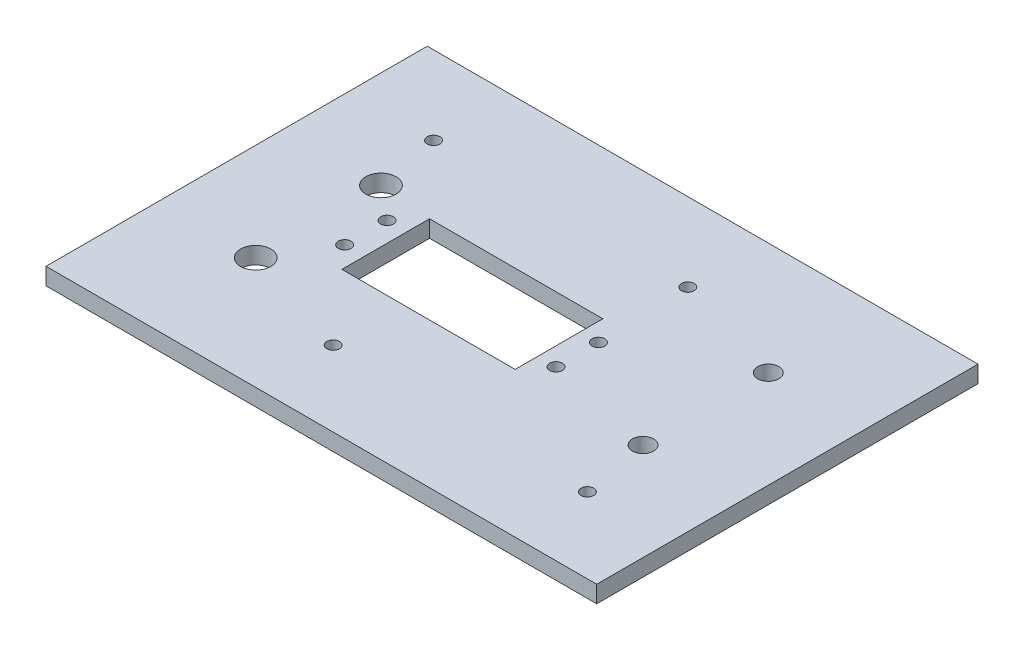
ISO-10303-21;
HEADER;
FILE_DESCRIPTION(('STEP AP214'),'2;1');
FILE_NAME('part.step','',(''),(''),'','','');
FILE_SCHEMA(('AUTOMOTIVE_DESIGN { 1 0 10303 214 1 1 1 1 }'));
ENDSEC;
DATA;
#1=APPLICATION_CONTEXT('core data for automotive mechanical design processes');
#2=APPLICATION_PROTOCOL_DEFINITION('international standard','automotive_design',2000,#1);
#3=PRODUCT_CONTEXT('',#1,'mechanical');
#4=PRODUCT('Part','Part','',(#3));
#5=PRODUCT_RELATED_PRODUCT_CATEGORY('part','',(#4));
#6=PRODUCT_DEFINITION_FORMATION('','',#4);
#7=PRODUCT_DEFINITION_CONTEXT('part definition',#1,'design');
#8=PRODUCT_DEFINITION('design','',#6,#7);
#9=PRODUCT_DEFINITION_SHAPE('','',#8);
#10=(LENGTH_UNIT() NAMED_UNIT(*) SI_UNIT(.MILLI.,.METRE.));
#11=(NAMED_UNIT(*) PLANE_ANGLE_UNIT() SI_UNIT($,.RADIAN.));
#12=(NAMED_UNIT(*) SI_UNIT($,.STERADIAN.) SOLID_ANGLE_UNIT());
#13=UNCERTAINTY_MEASURE_WITH_UNIT(LENGTH_MEASURE(1.E-05),#10,'distance_accuracy_value','');
#14=(GEOMETRIC_REPRESENTATION_CONTEXT(3) GLOBAL_UNCERTAINTY_ASSIGNED_CONTEXT((#13)) GLOBAL_UNIT_ASSIGNED_CONTEXT((#10,
#11,#12)) REPRESENTATION_CONTEXT('',''));
#15=CARTESIAN_POINT('',(0.,0.,0.));
#16=DIRECTION('',(0.,0.,1.));
#17=DIRECTION('',(1.,0.,0.));
#18=AXIS2_PLACEMENT_3D('',#15,#16,#17);
#19=CARTESIAN_POINT('',(-105.,4.,51.6723666974367));
#20=DIRECTION('',(1.,0.,0.));
#21=DIRECTION('',(0.,0.,-1.));
#22=AXIS2_PLACEMENT_3D('',#19,#20,#21);
#23=PLANE('',#22);
#24=DIRECTION('',(0.,0.,1.));
#25=VECTOR('',#24,1.);
#26=CARTESIAN_POINT('',(-105.,0.,51.6723666974367));
#27=LINE('',#26,#25);
#28=CARTESIAN_POINT('',(-105.,0.,-38.3276333025633));
#29=VERTEX_POINT('',#28);
#30=CARTESIAN_POINT('',(-105.,0.,51.6723666974367));
#31=VERTEX_POINT('',#30);
#32=EDGE_CURVE('E156',#29,#31,#27,.T.);
#33=ORIENTED_EDGE('',*,*,#32,.T.);
#34=DIRECTION('',(0.,-1.,0.));
#35=VECTOR('',#34,1.);
#36=CARTESIAN_POINT('',(-105.,4.,51.6723666974367));
#37=LINE('',#36,#35);
#38=CARTESIAN_POINT('',(-105.,4.,51.6723666974367));
#39=VERTEX_POINT('',#38);
#40=EDGE_CURVE('E11',#39,#31,#37,.T.);
#41=ORIENTED_EDGE('',*,*,#40,.F.);
#42=DIRECTION('',(0.,0.,1.));
#43=VECTOR('',#42,1.);
#44=CARTESIAN_POINT('',(-105.,4.,51.6723666974367));
#45=LINE('',#44,#43);
#46=CARTESIAN_POINT('',(-105.,4.,-38.3276333025633));
#47=VERTEX_POINT('',#46);
#48=EDGE_CURVE('E145',#47,#39,#45,.T.);
#49=ORIENTED_EDGE('',*,*,#48,.F.);
#50=DIRECTION('',(0.,-1.,0.));
#51=VECTOR('',#50,1.);
#52=CARTESIAN_POINT('',(-105.,4.,-38.3276333025633));
#53=LINE('',#52,#51);
#54=EDGE_CURVE('E155',#47,#29,#53,.T.);
#55=ORIENTED_EDGE('',*,*,#54,.T.);
#56=EDGE_LOOP('',(#33,#41,#49,#55));
#57=FACE_BOUND('',#56,.T.);
#58=ADVANCED_FACE('F32',(#57),#23,.F.);
#59=CARTESIAN_POINT('',(-105.,4.,51.6723666974367));
#60=DIRECTION('',(0.,0.,-1.));
#61=DIRECTION('',(-1.,0.,0.));
#62=AXIS2_PLACEMENT_3D('',#59,#60,#61);
#63=PLANE('',#62);
#64=DIRECTION('',(1.,0.,0.));
#65=VECTOR('',#64,1.);
#66=CARTESIAN_POINT('',(-105.,0.,51.6723666974367));
#67=LINE('',#66,#65);
#68=CARTESIAN_POINT('',(25.,0.,51.6723666974367));
#69=VERTEX_POINT('',#68);
#70=EDGE_CURVE('E159',#31,#69,#67,.T.);
#71=ORIENTED_EDGE('',*,*,#70,.T.);
#72=DIRECTION('',(0.,-1.,0.));
#73=VECTOR('',#72,1.);
#74=CARTESIAN_POINT('',(25.,4.,51.6723666974367));
#75=LINE('',#74,#73);
#76=CARTESIAN_POINT('',(25.,4.,51.6723666974367));
#77=VERTEX_POINT('',#76);
#78=EDGE_CURVE('E40',#77,#69,#75,.T.);
#79=ORIENTED_EDGE('',*,*,#78,.F.);
#80=DIRECTION('',(1.,0.,0.));
#81=VECTOR('',#80,1.);
#82=CARTESIAN_POINT('',(-105.,4.,51.6723666974367));
#83=LINE('',#82,#81);
#84=EDGE_CURVE('E148',#39,#77,#83,.T.);
#85=ORIENTED_EDGE('',*,*,#84,.F.);
#86=ORIENTED_EDGE('',*,*,#40,.T.);
#87=EDGE_LOOP('',(#71,#79,#85,#86));
#88=FACE_BOUND('',#87,.T.);
#89=ADVANCED_FACE('F264',(#88),#63,.F.);
#90=CARTESIAN_POINT('',(25.,4.,51.6723666974367));
#91=DIRECTION('',(-1.,0.,0.));
#92=DIRECTION('',(0.,0.,1.));
#93=AXIS2_PLACEMENT_3D('',#90,#91,#92);
#94=PLANE('',#93);
#95=DIRECTION('',(0.,0.,-1.));
#96=VECTOR('',#95,1.);
#97=CARTESIAN_POINT('',(25.,0.,51.6723666974367));
#98=LINE('',#97,#96);
#99=CARTESIAN_POINT('',(25.,0.,-38.3276333025633));
#100=VERTEX_POINT('',#99);
#101=EDGE_CURVE('E161',#69,#100,#98,.T.);
#102=ORIENTED_EDGE('',*,*,#101,.T.);
#103=DIRECTION('',(0.,-1.,0.));
#104=VECTOR('',#103,1.);
#105=CARTESIAN_POINT('',(25.,4.,-38.3276333025633));
#106=LINE('',#105,#104);
#107=CARTESIAN_POINT('',(25.,4.,-38.3276333025633));
#108=VERTEX_POINT('',#107);
#109=EDGE_CURVE('E166',#108,#100,#106,.T.);
#110=ORIENTED_EDGE('',*,*,#109,.F.);
#111=DIRECTION('',(0.,0.,-1.));
#112=VECTOR('',#111,1.);
#113=CARTESIAN_POINT('',(25.,4.,51.6723666974367));
#114=LINE('',#113,#112);
#115=EDGE_CURVE('E151',#77,#108,#114,.T.);
#116=ORIENTED_EDGE('',*,*,#115,.F.);
#117=ORIENTED_EDGE('',*,*,#78,.T.);
#118=EDGE_LOOP('',(#102,#110,#116,#117));
#119=FACE_BOUND('',#118,.T.);
#120=ADVANCED_FACE('F269',(#119),#94,.F.);
#121=CARTESIAN_POINT('',(-105.,4.,-38.3276333025633));
#122=DIRECTION('',(0.,0.,1.));
#123=DIRECTION('',(1.,0.,0.));
#124=AXIS2_PLACEMENT_3D('',#121,#122,#123);
#125=PLANE('',#124);
#126=DIRECTION('',(-1.,0.,0.));
#127=VECTOR('',#126,1.);
#128=CARTESIAN_POINT('',(-105.,0.,-38.3276333025633));
#129=LINE('',#128,#127);
#130=EDGE_CURVE('E149',#100,#29,#129,.T.);
#131=ORIENTED_EDGE('',*,*,#130,.T.);
#132=ORIENTED_EDGE('',*,*,#54,.F.);
#133=DIRECTION('',(-1.,0.,0.));
#134=VECTOR('',#133,1.);
#135=CARTESIAN_POINT('',(-105.,4.,-38.3276333025633));
#136=LINE('',#135,#134);
#137=EDGE_CURVE('E153',#108,#47,#136,.T.);
#138=ORIENTED_EDGE('',*,*,#137,.F.);
#139=ORIENTED_EDGE('',*,*,#109,.T.);
#140=EDGE_LOOP('',(#131,#132,#138,#139));
#141=FACE_BOUND('',#140,.T.);
#142=ADVANCED_FACE('F276',(#141),#125,.F.);
#143=CARTESIAN_POINT('',(0.,4.,0.));
#144=DIRECTION('',(0.,-1.,0.));
#145=DIRECTION('',(0.,0.,-1.));
#146=AXIS2_PLACEMENT_3D('',#143,#144,#145);
#147=PLANE('',#146);
#148=CARTESIAN_POINT('',(-25.,4.,-19.8195341520518));
#149=DIRECTION('',(0.,1.,0.));
#150=DIRECTION('',(0.,0.,1.));
#151=AXIS2_PLACEMENT_3D('',#148,#149,#150);
#152=CIRCLE('',#151,1.5);
#153=CARTESIAN_POINT('',(-25.,4.,-18.3195341520518));
#154=VERTEX_POINT('',#153);
#155=EDGE_CURVE('E196',#154,#154,#152,.T.);
#156=ORIENTED_EDGE('',*,*,#155,.F.);
#157=EDGE_LOOP('',(#156));
#158=FACE_BOUND('',#157,.T.);
#159=CARTESIAN_POINT('',(5.00000000000001,4.,33.8804658479482));
#160=DIRECTION('',(0.,1.,0.));
#161=DIRECTION('',(0.,0.,1.));
#162=AXIS2_PLACEMENT_3D('',#159,#160,#161);
#163=CIRCLE('',#162,1.5);
#164=CARTESIAN_POINT('',(5.00000000000001,4.,35.3804658479482));
#165=VERTEX_POINT('',#164);
#166=EDGE_CURVE('E207',#165,#165,#163,.T.);
#167=ORIENTED_EDGE('',*,*,#166,.F.);
#168=EDGE_LOOP('',(#167));
#169=FACE_BOUND('',#168,.T.);
#170=CARTESIAN_POINT('',(-55.,4.,33.8804658479482));
#171=DIRECTION('',(0.,1.,0.));
#172=DIRECTION('',(0.,0.,1.));
#173=AXIS2_PLACEMENT_3D('',#170,#171,#172);
#174=CIRCLE('',#173,1.5);
#175=CARTESIAN_POINT('',(-55.,4.,35.3804658479482));
#176=VERTEX_POINT('',#175);
#177=EDGE_CURVE('E213',#176,#176,#174,.T.);
#178=ORIENTED_EDGE('',*,*,#177,.F.);
#179=EDGE_LOOP('',(#178));
#180=FACE_BOUND('',#179,.T.);
#181=CARTESIAN_POINT('',(-85.,4.,-19.8195341520518));
#182=DIRECTION('',(0.,1.,0.));
#183=DIRECTION('',(0.,0.,1.));
#184=AXIS2_PLACEMENT_3D('',#181,#182,#183);
#185=CIRCLE('',#184,1.5);
#186=CARTESIAN_POINT('',(-85.,4.,-18.3195341520518));
#187=VERTEX_POINT('',#186);
#188=EDGE_CURVE('E216',#187,#187,#185,.T.);
#189=ORIENTED_EDGE('',*,*,#188,.F.);
#190=EDGE_LOOP('',(#189));
#191=FACE_BOUND('',#190,.T.);
#192=CARTESIAN_POINT('',(-24.2394353720915,4.,2.03046584794823));
#193=DIRECTION('',(0.,-1.,0.));
#194=DIRECTION('',(0.,0.,-1.));
#195=AXIS2_PLACEMENT_3D('',#192,#193,#194);
#196=CIRCLE('',#195,1.5);
#197=CARTESIAN_POINT('',(-24.2394353720915,4.,0.530465847948223));
#198=VERTEX_POINT('',#197);
#199=EDGE_CURVE('E225',#198,#198,#196,.T.);
#200=ORIENTED_EDGE('',*,*,#199,.T.);
#201=EDGE_LOOP('',(#200));
#202=FACE_BOUND('',#201,.T.);
#203=CARTESIAN_POINT('',(-74.1394353720915,4.,2.03046584794823));
#204=DIRECTION('',(0.,-1.,0.));
#205=DIRECTION('',(0.,0.,-1.));
#206=AXIS2_PLACEMENT_3D('',#203,#204,#205);
#207=CIRCLE('',#206,1.5);
#208=CARTESIAN_POINT('',(-74.1394353720915,4.,0.53046584794823));
#209=VERTEX_POINT('',#208);
#210=EDGE_CURVE('E231',#209,#209,#207,.T.);
#211=ORIENTED_EDGE('',*,*,#210,.T.);
#212=EDGE_LOOP('',(#211));
#213=FACE_BOUND('',#212,.T.);
#214=CARTESIAN_POINT('',(-24.2394353720915,4.,12.0304658479482));
#215=DIRECTION('',(0.,-1.,0.));
#216=DIRECTION('',(0.,0.,-1.));
#217=AXIS2_PLACEMENT_3D('',#214,#215,#216);
#218=CIRCLE('',#217,1.5);
#219=CARTESIAN_POINT('',(-24.2394353720915,4.,10.5304658479482));
#220=VERTEX_POINT('',#219);
#221=EDGE_CURVE('E237',#220,#220,#218,.T.);
#222=ORIENTED_EDGE('',*,*,#221,.T.);
#223=EDGE_LOOP('',(#222));
#224=FACE_BOUND('',#223,.T.);
#225=CARTESIAN_POINT('',(-74.1394353720915,4.,12.0304658479482));
#226=DIRECTION('',(0.,-1.,0.));
#227=DIRECTION('',(0.,0.,-1.));
#228=AXIS2_PLACEMENT_3D('',#225,#226,#227);
#229=CIRCLE('',#228,1.5);
#230=CARTESIAN_POINT('',(-74.1394353720915,4.,10.5304658479482));
#231=VERTEX_POINT('',#230);
#232=EDGE_CURVE('E129',#231,#231,#229,.T.);
#233=ORIENTED_EDGE('',*,*,#232,.T.);
#234=EDGE_LOOP('',(#233));
#235=FACE_BOUND('',#234,.T.);
#236=DIRECTION('',(1.,0.,0.));
#237=VECTOR('',#236,1.);
#238=CARTESIAN_POINT('',(-69.45,4.,17.3804658479482));
#239=LINE('',#238,#237);
#240=CARTESIAN_POINT('',(-69.45,4.,17.3804658479482));
#241=VERTEX_POINT('',#240);
#242=CARTESIAN_POINT('',(-28.55,4.,17.3804658479482));
#243=VERTEX_POINT('',#242);
#244=EDGE_CURVE('E128',#241,#243,#239,.T.);
#245=ORIENTED_EDGE('',*,*,#244,.F.);
#246=DIRECTION('',(0.,0.,1.));
#247=VECTOR('',#246,1.);
#248=CARTESIAN_POINT('',(-69.45,4.,-3.31953415205177));
#249=LINE('',#248,#247);
#250=CARTESIAN_POINT('',(-69.45,4.,-3.31953415205177));
#251=VERTEX_POINT('',#250);
#252=EDGE_CURVE('E48',#251,#241,#249,.T.);
#253=ORIENTED_EDGE('',*,*,#252,.F.);
#254=DIRECTION('',(-1.,0.,0.));
#255=VECTOR('',#254,1.);
#256=CARTESIAN_POINT('',(-69.45,4.,-3.31953415205177));
#257=LINE('',#256,#255);
#258=CARTESIAN_POINT('',(-28.55,4.,-3.31953415205177));
#259=VERTEX_POINT('',#258);
#260=EDGE_CURVE('E116',#259,#251,#257,.T.);
#261=ORIENTED_EDGE('',*,*,#260,.F.);
#262=DIRECTION('',(0.,0.,-1.));
#263=VECTOR('',#262,1.);
#264=CARTESIAN_POINT('',(-28.55,4.,-3.31953415205177));
#265=LINE('',#264,#263);
#266=EDGE_CURVE('E119',#243,#259,#265,.T.);
#267=ORIENTED_EDGE('',*,*,#266,.F.);
#268=EDGE_LOOP('',(#245,#253,#261,#267));
#269=FACE_BOUND('',#268,.T.);
#270=CARTESIAN_POINT('',(-82.,4.,25.1723666974366));
#271=DIRECTION('',(0.,1.,0.));
#272=DIRECTION('',(0.,0.,1.));
#273=AXIS2_PLACEMENT_3D('',#270,#271,#272);
#274=CIRCLE('',#273,3.57);
#275=CARTESIAN_POINT('',(-82.,4.,28.7423666974366));
#276=VERTEX_POINT('',#275);
#277=EDGE_CURVE('E135',#276,#276,#274,.T.);
#278=ORIENTED_EDGE('',*,*,#277,.F.);
#279=EDGE_LOOP('',(#278));
#280=FACE_BOUND('',#279,.T.);
#281=CARTESIAN_POINT('',(-82.,4.,-4.39331594725367));
#282=DIRECTION('',(0.,1.,0.));
#283=DIRECTION('',(0.,0.,1.));
#284=AXIS2_PLACEMENT_3D('',#281,#282,#283);
#285=CIRCLE('',#284,3.57);
#286=CARTESIAN_POINT('',(-82.,4.,-0.823315947253672));
#287=VERTEX_POINT('',#286);
#288=EDGE_CURVE('E141',#287,#287,#285,.T.);
#289=ORIENTED_EDGE('',*,*,#288,.F.);
#290=EDGE_LOOP('',(#289));
#291=FACE_BOUND('',#290,.T.);
#292=ORIENTED_EDGE('',*,*,#48,.T.);
#293=ORIENTED_EDGE('',*,*,#84,.T.);
#294=ORIENTED_EDGE('',*,*,#115,.T.);
#295=ORIENTED_EDGE('',*,*,#137,.T.);
#296=EDGE_LOOP('',(#292,#293,#294,#295));
#297=FACE_BOUND('',#296,.T.);
#298=CARTESIAN_POINT('',(2.00000000000002,4.,17.738049342127));
#299=DIRECTION('',(0.,1.,0.));
#300=DIRECTION('',(0.,0.,1.));
#301=AXIS2_PLACEMENT_3D('',#298,#299,#300);
#302=CIRCLE('',#301,2.5);
#303=CARTESIAN_POINT('',(2.00000000000002,4.,20.238049342127));
#304=VERTEX_POINT('',#303);
#305=EDGE_CURVE('E201',#304,#304,#302,.T.);
#306=ORIENTED_EDGE('',*,*,#305,.F.);
#307=EDGE_LOOP('',(#306));
#308=FACE_BOUND('',#307,.T.);
#309=CARTESIAN_POINT('',(2.00000000000001,4.,-11.8276333025634));
#310=DIRECTION('',(0.,1.,0.));
#311=DIRECTION('',(0.,0.,1.));
#312=AXIS2_PLACEMENT_3D('',#309,#310,#311);
#313=CIRCLE('',#312,2.5);
#314=CARTESIAN_POINT('',(2.00000000000001,4.,-9.32763330256336));
#315=VERTEX_POINT('',#314);
#316=EDGE_CURVE('E193',#315,#315,#313,.T.);
#317=ORIENTED_EDGE('',*,*,#316,.F.);
#318=EDGE_LOOP('',(#317));
#319=FACE_BOUND('',#318,.T.);
#320=ADVANCED_FACE('F178',(#158,#169,#180,#191,#202,#213,#224,#235,#269,#280,#291,#297,#308,
#319),#147,.F.);
#321=CARTESIAN_POINT('',(0.,0.,0.));
#322=DIRECTION('',(0.,-1.,0.));
#323=DIRECTION('',(0.,0.,-1.));
#324=AXIS2_PLACEMENT_3D('',#321,#322,#323);
#325=PLANE('',#324);
#326=CARTESIAN_POINT('',(-25.,0.,-19.8195341520518));
#327=DIRECTION('',(0.,1.,0.));
#328=DIRECTION('',(0.,0.,1.));
#329=AXIS2_PLACEMENT_3D('',#326,#327,#328);
#330=CIRCLE('',#329,1.5);
#331=CARTESIAN_POINT('',(-25.,0.,-18.3195341520518));
#332=VERTEX_POINT('',#331);
#333=EDGE_CURVE('E192',#332,#332,#330,.T.);
#334=ORIENTED_EDGE('',*,*,#333,.T.);
#335=EDGE_LOOP('',(#334));
#336=FACE_BOUND('',#335,.T.);
#337=CARTESIAN_POINT('',(5.00000000000001,0.,33.8804658479482));
#338=DIRECTION('',(0.,1.,0.));
#339=DIRECTION('',(0.,0.,1.));
#340=AXIS2_PLACEMENT_3D('',#337,#338,#339);
#341=CIRCLE('',#340,1.5);
#342=CARTESIAN_POINT('',(5.00000000000001,0.,35.3804658479482));
#343=VERTEX_POINT('',#342);
#344=EDGE_CURVE('E205',#343,#343,#341,.T.);
#345=ORIENTED_EDGE('',*,*,#344,.T.);
#346=EDGE_LOOP('',(#345));
#347=FACE_BOUND('',#346,.T.);
#348=CARTESIAN_POINT('',(-55.,0.,33.8804658479482));
#349=DIRECTION('',(0.,1.,0.));
#350=DIRECTION('',(0.,0.,1.));
#351=AXIS2_PLACEMENT_3D('',#348,#349,#350);
#352=CIRCLE('',#351,1.5);
#353=CARTESIAN_POINT('',(-55.,0.,35.3804658479482));
#354=VERTEX_POINT('',#353);
#355=EDGE_CURVE('E210',#354,#354,#352,.T.);
#356=ORIENTED_EDGE('',*,*,#355,.T.);
#357=EDGE_LOOP('',(#356));
#358=FACE_BOUND('',#357,.T.);
#359=CARTESIAN_POINT('',(-85.,0.,-19.8195341520518));
#360=DIRECTION('',(0.,1.,0.));
#361=DIRECTION('',(0.,0.,1.));
#362=AXIS2_PLACEMENT_3D('',#359,#360,#361);
#363=CIRCLE('',#362,1.5);
#364=CARTESIAN_POINT('',(-85.,0.,-18.3195341520518));
#365=VERTEX_POINT('',#364);
#366=EDGE_CURVE('E219',#365,#365,#363,.T.);
#367=ORIENTED_EDGE('',*,*,#366,.T.);
#368=EDGE_LOOP('',(#367));
#369=FACE_BOUND('',#368,.T.);
#370=CARTESIAN_POINT('',(-24.2394353720915,0.,2.03046584794823));
#371=DIRECTION('',(0.,-1.,0.));
#372=DIRECTION('',(0.,0.,-1.));
#373=AXIS2_PLACEMENT_3D('',#370,#371,#372);
#374=CIRCLE('',#373,1.5);
#375=CARTESIAN_POINT('',(-24.2394353720915,0.,0.530465847948223));
#376=VERTEX_POINT('',#375);
#377=EDGE_CURVE('E222',#376,#376,#374,.T.);
#378=ORIENTED_EDGE('',*,*,#377,.F.);
#379=EDGE_LOOP('',(#378));
#380=FACE_BOUND('',#379,.T.);
#381=CARTESIAN_POINT('',(-74.1394353720915,0.,2.03046584794823));
#382=DIRECTION('',(0.,-1.,0.));
#383=DIRECTION('',(0.,0.,-1.));
#384=AXIS2_PLACEMENT_3D('',#381,#382,#383);
#385=CIRCLE('',#384,1.5);
#386=CARTESIAN_POINT('',(-74.1394353720915,0.,0.53046584794823));
#387=VERTEX_POINT('',#386);
#388=EDGE_CURVE('E228',#387,#387,#385,.T.);
#389=ORIENTED_EDGE('',*,*,#388,.F.);
#390=EDGE_LOOP('',(#389));
#391=FACE_BOUND('',#390,.T.);
#392=CARTESIAN_POINT('',(-24.2394353720915,0.,12.0304658479482));
#393=DIRECTION('',(0.,-1.,0.));
#394=DIRECTION('',(0.,0.,-1.));
#395=AXIS2_PLACEMENT_3D('',#392,#393,#394);
#396=CIRCLE('',#395,1.5);
#397=CARTESIAN_POINT('',(-24.2394353720915,0.,10.5304658479482));
#398=VERTEX_POINT('',#397);
#399=EDGE_CURVE('E234',#398,#398,#396,.T.);
#400=ORIENTED_EDGE('',*,*,#399,.F.);
#401=EDGE_LOOP('',(#400));
#402=FACE_BOUND('',#401,.T.);
#403=CARTESIAN_POINT('',(-74.1394353720915,0.,12.0304658479482));
#404=DIRECTION('',(0.,-1.,0.));
#405=DIRECTION('',(0.,0.,-1.));
#406=AXIS2_PLACEMENT_3D('',#403,#404,#405);
#407=CIRCLE('',#406,1.5);
#408=CARTESIAN_POINT('',(-74.1394353720915,0.,10.5304658479482));
#409=VERTEX_POINT('',#408);
#410=EDGE_CURVE('E122',#409,#409,#407,.T.);
#411=ORIENTED_EDGE('',*,*,#410,.F.);
#412=EDGE_LOOP('',(#411));
#413=FACE_BOUND('',#412,.T.);
#414=DIRECTION('',(0.,0.,1.));
#415=VECTOR('',#414,1.);
#416=CARTESIAN_POINT('',(-69.45,0.,-3.31953415205177));
#417=LINE('',#416,#415);
#418=CARTESIAN_POINT('',(-69.45,0.,-3.31953415205177));
#419=VERTEX_POINT('',#418);
#420=CARTESIAN_POINT('',(-69.45,0.,17.3804658479482));
#421=VERTEX_POINT('',#420);
#422=EDGE_CURVE('E100',#419,#421,#417,.T.);
#423=ORIENTED_EDGE('',*,*,#422,.T.);
#424=DIRECTION('',(1.,0.,0.));
#425=VECTOR('',#424,1.);
#426=CARTESIAN_POINT('',(-69.45,0.,17.3804658479482));
#427=LINE('',#426,#425);
#428=CARTESIAN_POINT('',(-28.55,0.,17.3804658479482));
#429=VERTEX_POINT('',#428);
#430=EDGE_CURVE('E109',#421,#429,#427,.T.);
#431=ORIENTED_EDGE('',*,*,#430,.T.);
#432=DIRECTION('',(0.,0.,-1.));
#433=VECTOR('',#432,1.);
#434=CARTESIAN_POINT('',(-28.55,0.,-3.31953415205177));
#435=LINE('',#434,#433);
#436=CARTESIAN_POINT('',(-28.55,0.,-3.31953415205177));
#437=VERTEX_POINT('',#436);
#438=EDGE_CURVE('E56',#429,#437,#435,.T.);
#439=ORIENTED_EDGE('',*,*,#438,.T.);
#440=DIRECTION('',(-1.,0.,0.));
#441=VECTOR('',#440,1.);
#442=CARTESIAN_POINT('',(-69.45,0.,-3.31953415205177));
#443=LINE('',#442,#441);
#444=EDGE_CURVE('E106',#437,#419,#443,.T.);
#445=ORIENTED_EDGE('',*,*,#444,.T.);
#446=EDGE_LOOP('',(#423,#431,#439,#445));
#447=FACE_BOUND('',#446,.T.);
#448=CARTESIAN_POINT('',(-82.,0.,25.1723666974366));
#449=DIRECTION('',(0.,-1.,0.));
#450=DIRECTION('',(0.,0.,-1.));
#451=AXIS2_PLACEMENT_3D('',#448,#449,#450);
#452=CIRCLE('',#451,3.57);
#453=CARTESIAN_POINT('',(-82.,0.,21.6023666974367));
#454=VERTEX_POINT('',#453);
#455=EDGE_CURVE('E35',#454,#454,#452,.T.);
#456=ORIENTED_EDGE('',*,*,#455,.F.);
#457=EDGE_LOOP('',(#456));
#458=FACE_BOUND('',#457,.T.);
#459=CARTESIAN_POINT('',(-82.,0.,-4.39331594725367));
#460=DIRECTION('',(0.,-1.,0.));
#461=DIRECTION('',(0.,0.,-1.));
#462=AXIS2_PLACEMENT_3D('',#459,#460,#461);
#463=CIRCLE('',#462,3.57);
#464=CARTESIAN_POINT('',(-82.,0.,-7.96331594725367));
#465=VERTEX_POINT('',#464);
#466=EDGE_CURVE('E144',#465,#465,#463,.T.);
#467=ORIENTED_EDGE('',*,*,#466,.F.);
#468=EDGE_LOOP('',(#467));
#469=FACE_BOUND('',#468,.T.);
#470=ORIENTED_EDGE('',*,*,#32,.F.);
#471=ORIENTED_EDGE('',*,*,#130,.F.);
#472=ORIENTED_EDGE('',*,*,#101,.F.);
#473=ORIENTED_EDGE('',*,*,#70,.F.);
#474=EDGE_LOOP('',(#470,#471,#472,#473));
#475=FACE_BOUND('',#474,.T.);
#476=CARTESIAN_POINT('',(2.00000000000002,0.,17.738049342127));
#477=DIRECTION('',(0.,1.,0.));
#478=DIRECTION('',(0.,0.,1.));
#479=AXIS2_PLACEMENT_3D('',#476,#477,#478);
#480=CIRCLE('',#479,2.5);
#481=CARTESIAN_POINT('',(2.00000000000002,0.,20.238049342127));
#482=VERTEX_POINT('',#481);
#483=EDGE_CURVE('E187',#482,#482,#480,.T.);
#484=ORIENTED_EDGE('',*,*,#483,.T.);
#485=EDGE_LOOP('',(#484));
#486=FACE_BOUND('',#485,.T.);
#487=CARTESIAN_POINT('',(2.00000000000001,0.,-11.8276333025634));
#488=DIRECTION('',(0.,1.,0.));
#489=DIRECTION('',(0.,0.,1.));
#490=AXIS2_PLACEMENT_3D('',#487,#488,#489);
#491=CIRCLE('',#490,2.5);
#492=CARTESIAN_POINT('',(2.00000000000001,0.,-9.32763330256336));
#493=VERTEX_POINT('',#492);
#494=EDGE_CURVE('E190',#493,#493,#491,.T.);
#495=ORIENTED_EDGE('',*,*,#494,.T.);
#496=EDGE_LOOP('',(#495));
#497=FACE_BOUND('',#496,.T.);
#498=ADVANCED_FACE('F113',(#336,#347,#358,#369,#380,#391,#402,#413,#447,#458,#469,#475,#486,
#497),#325,.T.);
#499=CARTESIAN_POINT('',(-82.,-6.,-4.39331594725367));
#500=DIRECTION('',(0.,1.,0.));
#501=DIRECTION('',(0.,0.,1.));
#502=AXIS2_PLACEMENT_3D('',#499,#500,#501);
#503=CYLINDRICAL_SURFACE('',#502,3.57);
#504=ORIENTED_EDGE('',*,*,#466,.T.);
#505=EDGE_LOOP('',(#504));
#506=FACE_BOUND('',#505,.T.);
#507=ORIENTED_EDGE('',*,*,#288,.T.);
#508=EDGE_LOOP('',(#507));
#509=FACE_BOUND('',#508,.T.);
#510=ADVANCED_FACE('F173',(#506,#509),#503,.F.);
#511=CARTESIAN_POINT('',(-82.,-6.,25.1723666974366));
#512=DIRECTION('',(0.,1.,0.));
#513=DIRECTION('',(0.,0.,1.));
#514=AXIS2_PLACEMENT_3D('',#511,#512,#513);
#515=CYLINDRICAL_SURFACE('',#514,3.57);
#516=ORIENTED_EDGE('',*,*,#455,.T.);
#517=EDGE_LOOP('',(#516));
#518=FACE_BOUND('',#517,.T.);
#519=ORIENTED_EDGE('',*,*,#277,.T.);
#520=EDGE_LOOP('',(#519));
#521=FACE_BOUND('',#520,.T.);
#522=ADVANCED_FACE('F343',(#518,#521),#515,.F.);
#523=CARTESIAN_POINT('',(-69.45,0.,-3.31953415205177));
#524=DIRECTION('',(-1.,0.,0.));
#525=DIRECTION('',(0.,0.,1.));
#526=AXIS2_PLACEMENT_3D('',#523,#524,#525);
#527=PLANE('',#526);
#528=ORIENTED_EDGE('',*,*,#252,.T.);
#529=DIRECTION('',(0.,1.,0.));
#530=VECTOR('',#529,1.);
#531=CARTESIAN_POINT('',(-69.45,0.,17.3804658479482));
#532=LINE('',#531,#530);
#533=EDGE_CURVE('E96',#421,#241,#532,.T.);
#534=ORIENTED_EDGE('',*,*,#533,.F.);
#535=ORIENTED_EDGE('',*,*,#422,.F.);
#536=DIRECTION('',(0.,1.,0.));
#537=VECTOR('',#536,1.);
#538=CARTESIAN_POINT('',(-69.45,0.,-3.31953415205177));
#539=LINE('',#538,#537);
#540=EDGE_CURVE('E133',#419,#251,#539,.T.);
#541=ORIENTED_EDGE('',*,*,#540,.T.);
#542=EDGE_LOOP('',(#528,#534,#535,#541));
#543=FACE_BOUND('',#542,.T.);
#544=ADVANCED_FACE('F98',(#543),#527,.F.);
#545=CARTESIAN_POINT('',(-69.45,0.,-3.31953415205177));
#546=DIRECTION('',(0.,0.,-1.));
#547=DIRECTION('',(-1.,0.,0.));
#548=AXIS2_PLACEMENT_3D('',#545,#546,#547);
#549=PLANE('',#548);
#550=ORIENTED_EDGE('',*,*,#260,.T.);
#551=ORIENTED_EDGE('',*,*,#540,.F.);
#552=ORIENTED_EDGE('',*,*,#444,.F.);
#553=DIRECTION('',(0.,1.,0.));
#554=VECTOR('',#553,1.);
#555=CARTESIAN_POINT('',(-28.55,0.,-3.31953415205177));
#556=LINE('',#555,#554);
#557=EDGE_CURVE('E136',#437,#259,#556,.T.);
#558=ORIENTED_EDGE('',*,*,#557,.T.);
#559=EDGE_LOOP('',(#550,#551,#552,#558));
#560=FACE_BOUND('',#559,.T.);
#561=ADVANCED_FACE('F433',(#560),#549,.F.);
#562=CARTESIAN_POINT('',(-28.55,0.,-3.31953415205177));
#563=DIRECTION('',(1.,0.,0.));
#564=DIRECTION('',(0.,0.,-1.));
#565=AXIS2_PLACEMENT_3D('',#562,#563,#564);
#566=PLANE('',#565);
#567=ORIENTED_EDGE('',*,*,#266,.T.);
#568=ORIENTED_EDGE('',*,*,#557,.F.);
#569=ORIENTED_EDGE('',*,*,#438,.F.);
#570=DIRECTION('',(0.,1.,0.));
#571=VECTOR('',#570,1.);
#572=CARTESIAN_POINT('',(-28.55,0.,17.3804658479482));
#573=LINE('',#572,#571);
#574=EDGE_CURVE('E105',#429,#243,#573,.T.);
#575=ORIENTED_EDGE('',*,*,#574,.T.);
#576=EDGE_LOOP('',(#567,#568,#569,#575));
#577=FACE_BOUND('',#576,.T.);
#578=ADVANCED_FACE('F260',(#577),#566,.F.);
#579=CARTESIAN_POINT('',(-69.45,0.,17.3804658479482));
#580=DIRECTION('',(0.,0.,1.));
#581=DIRECTION('',(1.,0.,0.));
#582=AXIS2_PLACEMENT_3D('',#579,#580,#581);
#583=PLANE('',#582);
#584=ORIENTED_EDGE('',*,*,#244,.T.);
#585=ORIENTED_EDGE('',*,*,#574,.F.);
#586=ORIENTED_EDGE('',*,*,#430,.F.);
#587=ORIENTED_EDGE('',*,*,#533,.T.);
#588=EDGE_LOOP('',(#584,#585,#586,#587));
#589=FACE_BOUND('',#588,.T.);
#590=ADVANCED_FACE('F110',(#589),#583,.F.);
#591=CARTESIAN_POINT('',(-74.1394353720915,4.,12.0304658479482));
#592=DIRECTION('',(0.,-1.,0.));
#593=DIRECTION('',(0.,0.,-1.));
#594=AXIS2_PLACEMENT_3D('',#591,#592,#593);
#595=CYLINDRICAL_SURFACE('',#594,1.5);
#596=ORIENTED_EDGE('',*,*,#232,.F.);
#597=EDGE_LOOP('',(#596));
#598=FACE_BOUND('',#597,.T.);
#599=ORIENTED_EDGE('',*,*,#410,.T.);
#600=EDGE_LOOP('',(#599));
#601=FACE_BOUND('',#600,.T.);
#602=ADVANCED_FACE('F247',(#598,#601),#595,.F.);
#603=CARTESIAN_POINT('',(-24.2394353720915,4.,12.0304658479482));
#604=DIRECTION('',(0.,-1.,0.));
#605=DIRECTION('',(0.,0.,-1.));
#606=AXIS2_PLACEMENT_3D('',#603,#604,#605);
#607=CYLINDRICAL_SURFACE('',#606,1.5);
#608=ORIENTED_EDGE('',*,*,#221,.F.);
#609=EDGE_LOOP('',(#608));
#610=FACE_BOUND('',#609,.T.);
#611=ORIENTED_EDGE('',*,*,#399,.T.);
#612=EDGE_LOOP('',(#611));
#613=FACE_BOUND('',#612,.T.);
#614=ADVANCED_FACE('F250',(#610,#613),#607,.F.);
#615=CARTESIAN_POINT('',(-74.1394353720915,4.,2.03046584794823));
#616=DIRECTION('',(0.,-1.,0.));
#617=DIRECTION('',(0.,0.,-1.));
#618=AXIS2_PLACEMENT_3D('',#615,#616,#617);
#619=CYLINDRICAL_SURFACE('',#618,1.5);
#620=ORIENTED_EDGE('',*,*,#210,.F.);
#621=EDGE_LOOP('',(#620));
#622=FACE_BOUND('',#621,.T.);
#623=ORIENTED_EDGE('',*,*,#388,.T.);
#624=EDGE_LOOP('',(#623));
#625=FACE_BOUND('',#624,.T.);
#626=ADVANCED_FACE('F257',(#622,#625),#619,.F.);
#627=CARTESIAN_POINT('',(-24.2394353720915,4.,2.03046584794823));
#628=DIRECTION('',(0.,-1.,0.));
#629=DIRECTION('',(0.,0.,-1.));
#630=AXIS2_PLACEMENT_3D('',#627,#628,#629);
#631=CYLINDRICAL_SURFACE('',#630,1.5);
#632=ORIENTED_EDGE('',*,*,#199,.F.);
#633=EDGE_LOOP('',(#632));
#634=FACE_BOUND('',#633,.T.);
#635=ORIENTED_EDGE('',*,*,#377,.T.);
#636=EDGE_LOOP('',(#635));
#637=FACE_BOUND('',#636,.T.);
#638=ADVANCED_FACE('F317',(#634,#637),#631,.F.);
#639=CARTESIAN_POINT('',(-85.,0.,-19.8195341520518));
#640=DIRECTION('',(0.,1.,0.));
#641=DIRECTION('',(0.,0.,1.));
#642=AXIS2_PLACEMENT_3D('',#639,#640,#641);
#643=CYLINDRICAL_SURFACE('',#642,1.5);
#644=ORIENTED_EDGE('',*,*,#366,.F.);
#645=EDGE_LOOP('',(#644));
#646=FACE_BOUND('',#645,.T.);
#647=ORIENTED_EDGE('',*,*,#188,.T.);
#648=EDGE_LOOP('',(#647));
#649=FACE_BOUND('',#648,.T.);
#650=ADVANCED_FACE('F313',(#646,#649),#643,.F.);
#651=CARTESIAN_POINT('',(-55.,0.,33.8804658479482));
#652=DIRECTION('',(0.,1.,0.));
#653=DIRECTION('',(0.,0.,1.));
#654=AXIS2_PLACEMENT_3D('',#651,#652,#653);
#655=CYLINDRICAL_SURFACE('',#654,1.5);
#656=ORIENTED_EDGE('',*,*,#355,.F.);
#657=EDGE_LOOP('',(#656));
#658=FACE_BOUND('',#657,.T.);
#659=ORIENTED_EDGE('',*,*,#177,.T.);
#660=EDGE_LOOP('',(#659));
#661=FACE_BOUND('',#660,.T.);
#662=ADVANCED_FACE('F309',(#658,#661),#655,.F.);
#663=CARTESIAN_POINT('',(5.00000000000001,0.,33.8804658479482));
#664=DIRECTION('',(0.,1.,0.));
#665=DIRECTION('',(0.,0.,1.));
#666=AXIS2_PLACEMENT_3D('',#663,#664,#665);
#667=CYLINDRICAL_SURFACE('',#666,1.5);
#668=ORIENTED_EDGE('',*,*,#344,.F.);
#669=EDGE_LOOP('',(#668));
#670=FACE_BOUND('',#669,.T.);
#671=ORIENTED_EDGE('',*,*,#166,.T.);
#672=EDGE_LOOP('',(#671));
#673=FACE_BOUND('',#672,.T.);
#674=ADVANCED_FACE('F305',(#670,#673),#667,.F.);
#675=CARTESIAN_POINT('',(-25.,0.,-19.8195341520518));
#676=DIRECTION('',(0.,1.,0.));
#677=DIRECTION('',(0.,0.,1.));
#678=AXIS2_PLACEMENT_3D('',#675,#676,#677);
#679=CYLINDRICAL_SURFACE('',#678,1.5);
#680=ORIENTED_EDGE('',*,*,#333,.F.);
#681=EDGE_LOOP('',(#680));
#682=FACE_BOUND('',#681,.T.);
#683=ORIENTED_EDGE('',*,*,#155,.T.);
#684=EDGE_LOOP('',(#683));
#685=FACE_BOUND('',#684,.T.);
#686=ADVANCED_FACE('F299',(#682,#685),#679,.F.);
#687=CARTESIAN_POINT('',(2.00000000000002,0.,17.738049342127));
#688=DIRECTION('',(0.,1.,0.));
#689=DIRECTION('',(0.,0.,1.));
#690=AXIS2_PLACEMENT_3D('',#687,#688,#689);
#691=CYLINDRICAL_SURFACE('',#690,2.5);
#692=ORIENTED_EDGE('',*,*,#483,.F.);
#693=EDGE_LOOP('',(#692));
#694=FACE_BOUND('',#693,.T.);
#695=ORIENTED_EDGE('',*,*,#305,.T.);
#696=EDGE_LOOP('',(#695));
#697=FACE_BOUND('',#696,.T.);
#698=ADVANCED_FACE('F294',(#694,#697),#691,.F.);
#699=CARTESIAN_POINT('',(2.00000000000001,0.,-11.8276333025634));
#700=DIRECTION('',(0.,1.,0.));
#701=DIRECTION('',(0.,0.,1.));
#702=AXIS2_PLACEMENT_3D('',#699,#700,#701);
#703=CYLINDRICAL_SURFACE('',#702,2.5);
#704=ORIENTED_EDGE('',*,*,#494,.F.);
#705=EDGE_LOOP('',(#704));
#706=FACE_BOUND('',#705,.T.);
#707=ORIENTED_EDGE('',*,*,#316,.T.);
#708=EDGE_LOOP('',(#707));
#709=FACE_BOUND('',#708,.T.);
#710=ADVANCED_FACE('F292',(#706,#709),#703,.F.);
#711=CLOSED_SHELL('',(#58,#89,#120,#142,#320,#498,#510,#522,#544,#561,#578,#590,#602,#614,#626,
#638,#650,#662,#674,#686,#698,#710));
#712=MANIFOLD_SOLID_BREP('B2',#711);
#713=ADVANCED_BREP_SHAPE_REPRESENTATION('',(#18,#712),#14);
#714=SHAPE_DEFINITION_REPRESENTATION(#9,#713);
ENDSEC;
END-ISO-10303-21;
